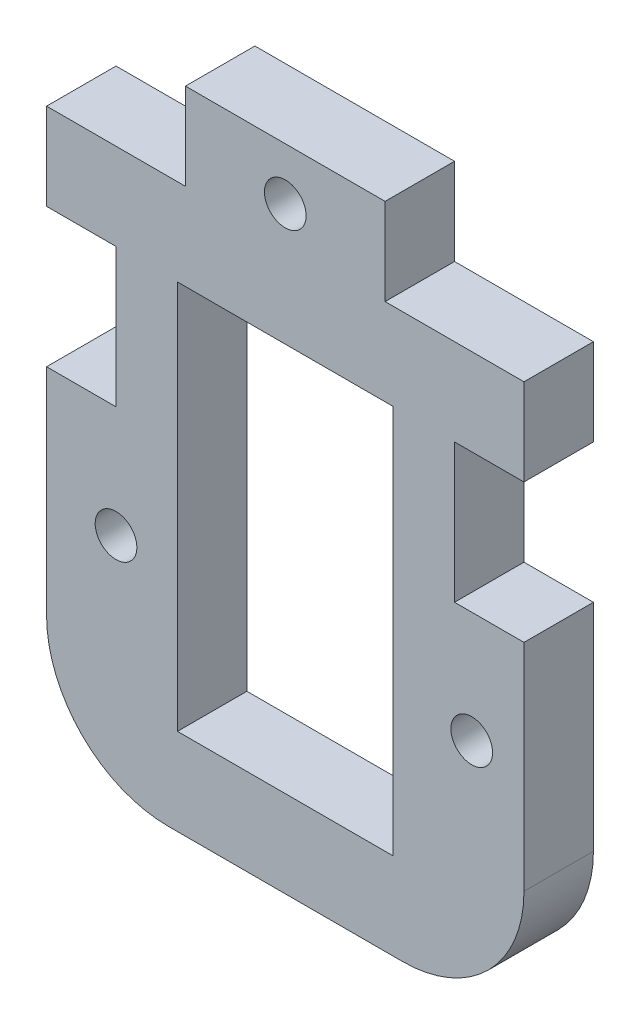
ISO-10303-21;
HEADER;
FILE_DESCRIPTION(('STEP AP214'),'2;1');
FILE_NAME('part.step','',(''),(''),'','','');
FILE_SCHEMA(('AUTOMOTIVE_DESIGN { 1 0 10303 214 1 1 1 1 }'));
ENDSEC;
DATA;
#1=APPLICATION_CONTEXT('core data for automotive mechanical design processes');
#2=APPLICATION_PROTOCOL_DEFINITION('international standard','automotive_design',2000,#1);
#3=PRODUCT_CONTEXT('',#1,'mechanical');
#4=PRODUCT('Part','Part','',(#3));
#5=PRODUCT_RELATED_PRODUCT_CATEGORY('part','',(#4));
#6=PRODUCT_DEFINITION_FORMATION('','',#4);
#7=PRODUCT_DEFINITION_CONTEXT('part definition',#1,'design');
#8=PRODUCT_DEFINITION('design','',#6,#7);
#9=PRODUCT_DEFINITION_SHAPE('','',#8);
#10=(LENGTH_UNIT() NAMED_UNIT(*) SI_UNIT(.MILLI.,.METRE.));
#11=(NAMED_UNIT(*) PLANE_ANGLE_UNIT() SI_UNIT($,.RADIAN.));
#12=(NAMED_UNIT(*) SI_UNIT($,.STERADIAN.) SOLID_ANGLE_UNIT());
#13=UNCERTAINTY_MEASURE_WITH_UNIT(LENGTH_MEASURE(1.E-05),#10,'distance_accuracy_value','');
#14=(GEOMETRIC_REPRESENTATION_CONTEXT(3) GLOBAL_UNCERTAINTY_ASSIGNED_CONTEXT((#13)) GLOBAL_UNIT_ASSIGNED_CONTEXT((#10,
#11,#12)) REPRESENTATION_CONTEXT('',''));
#15=CARTESIAN_POINT('',(0.,0.,0.));
#16=DIRECTION('',(0.,0.,1.));
#17=DIRECTION('',(1.,0.,0.));
#18=AXIS2_PLACEMENT_3D('',#15,#16,#17);
#19=CARTESIAN_POINT('',(7.54,0.,4.));
#20=DIRECTION('',(1.,0.,0.));
#21=DIRECTION('',(0.,0.,-1.));
#22=AXIS2_PLACEMENT_3D('',#19,#20,#21);
#23=PLANE('',#22);
#24=DIRECTION('',(0.,-1.,0.));
#25=VECTOR('',#24,1.);
#26=CARTESIAN_POINT('',(7.54,0.,0.));
#27=LINE('',#26,#25);
#28=CARTESIAN_POINT('',(7.54,27.42,0.));
#29=VERTEX_POINT('',#28);
#30=CARTESIAN_POINT('',(7.54,4.99999999999999,0.));
#31=VERTEX_POINT('',#30);
#32=EDGE_CURVE('E350',#29,#31,#27,.T.);
#33=ORIENTED_EDGE('',*,*,#32,.F.);
#34=DIRECTION('',(0.,0.,-1.));
#35=VECTOR('',#34,1.);
#36=CARTESIAN_POINT('',(7.54,27.42,4.));
#37=LINE('',#36,#35);
#38=CARTESIAN_POINT('',(7.54,27.42,4.));
#39=VERTEX_POINT('',#38);
#40=EDGE_CURVE('E376',#39,#29,#37,.T.);
#41=ORIENTED_EDGE('',*,*,#40,.F.);
#42=DIRECTION('',(0.,-1.,0.));
#43=VECTOR('',#42,1.);
#44=CARTESIAN_POINT('',(7.54,0.,4.));
#45=LINE('',#44,#43);
#46=CARTESIAN_POINT('',(7.54,4.99999999999999,4.));
#47=VERTEX_POINT('',#46);
#48=EDGE_CURVE('E269',#39,#47,#45,.T.);
#49=ORIENTED_EDGE('',*,*,#48,.T.);
#50=DIRECTION('',(0.,0.,-1.));
#51=VECTOR('',#50,1.);
#52=CARTESIAN_POINT('',(7.54,4.99999999999999,4.));
#53=LINE('',#52,#51);
#54=EDGE_CURVE('E201',#47,#31,#53,.T.);
#55=ORIENTED_EDGE('',*,*,#54,.T.);
#56=EDGE_LOOP('',(#33,#41,#49,#55));
#57=FACE_BOUND('',#56,.T.);
#58=ADVANCED_FACE('F39',(#57),#23,.T.);
#59=CARTESIAN_POINT('',(0.,27.42,4.));
#60=DIRECTION('',(0.,1.,0.));
#61=DIRECTION('',(0.,0.,1.));
#62=AXIS2_PLACEMENT_3D('',#59,#60,#61);
#63=PLANE('',#62);
#64=DIRECTION('',(1.,0.,0.));
#65=VECTOR('',#64,1.);
#66=CARTESIAN_POINT('',(0.,27.42,0.));
#67=LINE('',#66,#65);
#68=CARTESIAN_POINT('',(19.96,27.42,0.));
#69=VERTEX_POINT('',#68);
#70=EDGE_CURVE('E354',#29,#69,#67,.T.);
#71=ORIENTED_EDGE('',*,*,#70,.T.);
#72=DIRECTION('',(0.,0.,-1.));
#73=VECTOR('',#72,1.);
#74=CARTESIAN_POINT('',(19.96,27.42,4.));
#75=LINE('',#74,#73);
#76=CARTESIAN_POINT('',(19.96,27.42,4.));
#77=VERTEX_POINT('',#76);
#78=EDGE_CURVE('E372',#77,#69,#75,.T.);
#79=ORIENTED_EDGE('',*,*,#78,.F.);
#80=DIRECTION('',(1.,0.,0.));
#81=VECTOR('',#80,1.);
#82=CARTESIAN_POINT('',(0.,27.42,4.));
#83=LINE('',#82,#81);
#84=EDGE_CURVE('E273',#39,#77,#83,.T.);
#85=ORIENTED_EDGE('',*,*,#84,.F.);
#86=ORIENTED_EDGE('',*,*,#40,.T.);
#87=EDGE_LOOP('',(#71,#79,#85,#86));
#88=FACE_BOUND('',#87,.T.);
#89=ADVANCED_FACE('F517',(#88),#63,.F.);
#90=CARTESIAN_POINT('',(19.96,0.,4.));
#91=DIRECTION('',(1.,0.,0.));
#92=DIRECTION('',(0.,0.,-1.));
#93=AXIS2_PLACEMENT_3D('',#90,#91,#92);
#94=PLANE('',#93);
#95=DIRECTION('',(0.,-1.,0.));
#96=VECTOR('',#95,1.);
#97=CARTESIAN_POINT('',(19.96,0.,0.));
#98=LINE('',#97,#96);
#99=CARTESIAN_POINT('',(19.96,4.99999999999999,0.));
#100=VERTEX_POINT('',#99);
#101=EDGE_CURVE('E358',#69,#100,#98,.T.);
#102=ORIENTED_EDGE('',*,*,#101,.T.);
#103=DIRECTION('',(0.,0.,-1.));
#104=VECTOR('',#103,1.);
#105=CARTESIAN_POINT('',(19.96,4.99999999999999,4.));
#106=LINE('',#105,#104);
#107=CARTESIAN_POINT('',(19.96,4.99999999999999,4.));
#108=VERTEX_POINT('',#107);
#109=EDGE_CURVE('E369',#108,#100,#106,.T.);
#110=ORIENTED_EDGE('',*,*,#109,.F.);
#111=DIRECTION('',(0.,-1.,0.));
#112=VECTOR('',#111,1.);
#113=CARTESIAN_POINT('',(19.96,0.,4.));
#114=LINE('',#113,#112);
#115=EDGE_CURVE('E277',#77,#108,#114,.T.);
#116=ORIENTED_EDGE('',*,*,#115,.F.);
#117=ORIENTED_EDGE('',*,*,#78,.T.);
#118=EDGE_LOOP('',(#102,#110,#116,#117));
#119=FACE_BOUND('',#118,.T.);
#120=ADVANCED_FACE('F523',(#119),#94,.F.);
#121=CARTESIAN_POINT('',(23.5,0.,4.));
#122=DIRECTION('',(1.,0.,0.));
#123=DIRECTION('',(0.,1.,0.));
#124=AXIS2_PLACEMENT_3D('',#121,#122,#123);
#125=PLANE('',#124);
#126=DIRECTION('',(0.,-1.,0.));
#127=VECTOR('',#126,1.);
#128=CARTESIAN_POINT('',(23.5,0.,0.));
#129=LINE('',#128,#127);
#130=CARTESIAN_POINT('',(23.5,27.42,0.));
#131=VERTEX_POINT('',#130);
#132=CARTESIAN_POINT('',(23.5,19.42,0.));
#133=VERTEX_POINT('',#132);
#134=EDGE_CURVE('E195',#131,#133,#129,.T.);
#135=ORIENTED_EDGE('',*,*,#134,.F.);
#136=DIRECTION('',(0.,0.,-1.));
#137=VECTOR('',#136,1.);
#138=CARTESIAN_POINT('',(23.5,27.42,4.));
#139=LINE('',#138,#137);
#140=CARTESIAN_POINT('',(23.5,27.42,4.));
#141=VERTEX_POINT('',#140);
#142=EDGE_CURVE('E190',#141,#131,#139,.T.);
#143=ORIENTED_EDGE('',*,*,#142,.F.);
#144=DIRECTION('',(0.,-1.,0.));
#145=VECTOR('',#144,1.);
#146=CARTESIAN_POINT('',(23.5,0.,4.));
#147=LINE('',#146,#145);
#148=CARTESIAN_POINT('',(23.5,19.42,4.));
#149=VERTEX_POINT('',#148);
#150=EDGE_CURVE('E193',#141,#149,#147,.T.);
#151=ORIENTED_EDGE('',*,*,#150,.T.);
#152=DIRECTION('',(0.,0.,-1.));
#153=VECTOR('',#152,1.);
#154=CARTESIAN_POINT('',(23.5,19.42,4.));
#155=LINE('',#154,#153);
#156=EDGE_CURVE('E284',#149,#133,#155,.T.);
#157=ORIENTED_EDGE('',*,*,#156,.T.);
#158=EDGE_LOOP('',(#135,#143,#151,#157));
#159=FACE_BOUND('',#158,.T.);
#160=ADVANCED_FACE('F192',(#159),#125,.T.);
#161=CARTESIAN_POINT('',(0.,27.42,4.));
#162=DIRECTION('',(0.,-1.,0.));
#163=DIRECTION('',(0.,0.,-1.));
#164=AXIS2_PLACEMENT_3D('',#161,#162,#163);
#165=PLANE('',#164);
#166=DIRECTION('',(-1.,0.,0.));
#167=VECTOR('',#166,1.);
#168=CARTESIAN_POINT('',(0.,27.42,0.));
#169=LINE('',#168,#167);
#170=CARTESIAN_POINT('',(27.5,27.42,0.));
#171=VERTEX_POINT('',#170);
#172=EDGE_CURVE('E299',#171,#131,#169,.T.);
#173=ORIENTED_EDGE('',*,*,#172,.F.);
#174=DIRECTION('',(0.,0.,-1.));
#175=VECTOR('',#174,1.);
#176=CARTESIAN_POINT('',(27.5,27.42,4.));
#177=LINE('',#176,#175);
#178=CARTESIAN_POINT('',(27.5,27.42,4.));
#179=VERTEX_POINT('',#178);
#180=EDGE_CURVE('E202',#179,#171,#177,.T.);
#181=ORIENTED_EDGE('',*,*,#180,.F.);
#182=DIRECTION('',(-1.,0.,0.));
#183=VECTOR('',#182,1.);
#184=CARTESIAN_POINT('',(0.,27.42,4.));
#185=LINE('',#184,#183);
#186=EDGE_CURVE('E209',#179,#141,#185,.T.);
#187=ORIENTED_EDGE('',*,*,#186,.T.);
#188=ORIENTED_EDGE('',*,*,#142,.T.);
#189=EDGE_LOOP('',(#173,#181,#187,#188));
#190=FACE_BOUND('',#189,.T.);
#191=ADVANCED_FACE('F216',(#190),#165,.T.);
#192=CARTESIAN_POINT('',(27.5,0.,4.));
#193=DIRECTION('',(-1.,0.,0.));
#194=DIRECTION('',(0.,0.,1.));
#195=AXIS2_PLACEMENT_3D('',#192,#193,#194);
#196=PLANE('',#195);
#197=DIRECTION('',(0.,1.,0.));
#198=VECTOR('',#197,1.);
#199=CARTESIAN_POINT('',(27.5,0.,0.));
#200=LINE('',#199,#198);
#201=CARTESIAN_POINT('',(27.5,32.42,0.));
#202=VERTEX_POINT('',#201);
#203=EDGE_CURVE('E302',#171,#202,#200,.T.);
#204=ORIENTED_EDGE('',*,*,#203,.T.);
#205=DIRECTION('',(0.,0.,-1.));
#206=VECTOR('',#205,1.);
#207=CARTESIAN_POINT('',(27.5,32.42,4.));
#208=LINE('',#207,#206);
#209=CARTESIAN_POINT('',(27.5,32.42,4.));
#210=VERTEX_POINT('',#209);
#211=EDGE_CURVE('E415',#210,#202,#208,.T.);
#212=ORIENTED_EDGE('',*,*,#211,.F.);
#213=DIRECTION('',(0.,1.,0.));
#214=VECTOR('',#213,1.);
#215=CARTESIAN_POINT('',(27.5,0.,4.));
#216=LINE('',#215,#214);
#217=EDGE_CURVE('E219',#179,#210,#216,.T.);
#218=ORIENTED_EDGE('',*,*,#217,.F.);
#219=ORIENTED_EDGE('',*,*,#180,.T.);
#220=EDGE_LOOP('',(#204,#212,#218,#219));
#221=FACE_BOUND('',#220,.T.);
#222=ADVANCED_FACE('F503',(#221),#196,.F.);
#223=CARTESIAN_POINT('',(0.,32.42,4.));
#224=DIRECTION('',(0.,-1.,0.));
#225=DIRECTION('',(1.,0.,0.));
#226=AXIS2_PLACEMENT_3D('',#223,#224,#225);
#227=PLANE('',#226);
#228=DIRECTION('',(-1.,0.,0.));
#229=VECTOR('',#228,1.);
#230=CARTESIAN_POINT('',(0.,32.42,0.));
#231=LINE('',#230,#229);
#232=CARTESIAN_POINT('',(19.5,32.42,0.));
#233=VERTEX_POINT('',#232);
#234=EDGE_CURVE('E305',#202,#233,#231,.T.);
#235=ORIENTED_EDGE('',*,*,#234,.T.);
#236=DIRECTION('',(0.,0.,-1.));
#237=VECTOR('',#236,1.);
#238=CARTESIAN_POINT('',(19.5,32.42,4.));
#239=LINE('',#238,#237);
#240=CARTESIAN_POINT('',(19.5,32.42,4.));
#241=VERTEX_POINT('',#240);
#242=EDGE_CURVE('E412',#241,#233,#239,.T.);
#243=ORIENTED_EDGE('',*,*,#242,.F.);
#244=DIRECTION('',(-1.,0.,0.));
#245=VECTOR('',#244,1.);
#246=CARTESIAN_POINT('',(0.,32.42,4.));
#247=LINE('',#246,#245);
#248=EDGE_CURVE('E225',#210,#241,#247,.T.);
#249=ORIENTED_EDGE('',*,*,#248,.F.);
#250=ORIENTED_EDGE('',*,*,#211,.T.);
#251=EDGE_LOOP('',(#235,#243,#249,#250));
#252=FACE_BOUND('',#251,.T.);
#253=ADVANCED_FACE('F501',(#252),#227,.F.);
#254=CARTESIAN_POINT('',(19.5,0.,4.));
#255=DIRECTION('',(1.,0.,0.));
#256=DIRECTION('',(0.,0.,-1.));
#257=AXIS2_PLACEMENT_3D('',#254,#255,#256);
#258=PLANE('',#257);
#259=DIRECTION('',(0.,-1.,0.));
#260=VECTOR('',#259,1.);
#261=CARTESIAN_POINT('',(19.5,0.,0.));
#262=LINE('',#261,#260);
#263=CARTESIAN_POINT('',(19.5,37.42,0.));
#264=VERTEX_POINT('',#263);
#265=EDGE_CURVE('E310',#264,#233,#262,.T.);
#266=ORIENTED_EDGE('',*,*,#265,.F.);
#267=DIRECTION('',(0.,0.,-1.));
#268=VECTOR('',#267,1.);
#269=CARTESIAN_POINT('',(19.5,37.42,4.));
#270=LINE('',#269,#268);
#271=CARTESIAN_POINT('',(19.5,37.42,4.));
#272=VERTEX_POINT('',#271);
#273=EDGE_CURVE('E409',#272,#264,#270,.T.);
#274=ORIENTED_EDGE('',*,*,#273,.F.);
#275=DIRECTION('',(0.,-1.,0.));
#276=VECTOR('',#275,1.);
#277=CARTESIAN_POINT('',(19.5,0.,4.));
#278=LINE('',#277,#276);
#279=EDGE_CURVE('E232',#272,#241,#278,.T.);
#280=ORIENTED_EDGE('',*,*,#279,.T.);
#281=ORIENTED_EDGE('',*,*,#242,.T.);
#282=EDGE_LOOP('',(#266,#274,#280,#281));
#283=FACE_BOUND('',#282,.T.);
#284=ADVANCED_FACE('F496',(#283),#258,.T.);
#285=CARTESIAN_POINT('',(0.,37.42,4.));
#286=DIRECTION('',(0.,1.,0.));
#287=DIRECTION('',(0.,0.,1.));
#288=AXIS2_PLACEMENT_3D('',#285,#286,#287);
#289=PLANE('',#288);
#290=DIRECTION('',(1.,0.,0.));
#291=VECTOR('',#290,1.);
#292=CARTESIAN_POINT('',(0.,37.42,0.));
#293=LINE('',#292,#291);
#294=CARTESIAN_POINT('',(8.,37.42,0.));
#295=VERTEX_POINT('',#294);
#296=EDGE_CURVE('E314',#295,#264,#293,.T.);
#297=ORIENTED_EDGE('',*,*,#296,.F.);
#298=DIRECTION('',(0.,0.,-1.));
#299=VECTOR('',#298,1.);
#300=CARTESIAN_POINT('',(8.,37.42,4.));
#301=LINE('',#300,#299);
#302=CARTESIAN_POINT('',(8.,37.42,4.));
#303=VERTEX_POINT('',#302);
#304=EDGE_CURVE('E406',#303,#295,#301,.T.);
#305=ORIENTED_EDGE('',*,*,#304,.F.);
#306=DIRECTION('',(1.,0.,0.));
#307=VECTOR('',#306,1.);
#308=CARTESIAN_POINT('',(0.,37.42,4.));
#309=LINE('',#308,#307);
#310=EDGE_CURVE('E236',#303,#272,#309,.T.);
#311=ORIENTED_EDGE('',*,*,#310,.T.);
#312=ORIENTED_EDGE('',*,*,#273,.T.);
#313=EDGE_LOOP('',(#297,#305,#311,#312));
#314=FACE_BOUND('',#313,.T.);
#315=ADVANCED_FACE('F492',(#314),#289,.T.);
#316=CARTESIAN_POINT('',(8.,0.,4.));
#317=DIRECTION('',(-1.,0.,0.));
#318=DIRECTION('',(0.,0.,1.));
#319=AXIS2_PLACEMENT_3D('',#316,#317,#318);
#320=PLANE('',#319);
#321=DIRECTION('',(0.,1.,0.));
#322=VECTOR('',#321,1.);
#323=CARTESIAN_POINT('',(8.,0.,0.));
#324=LINE('',#323,#322);
#325=CARTESIAN_POINT('',(8.,32.42,0.));
#326=VERTEX_POINT('',#325);
#327=EDGE_CURVE('E318',#326,#295,#324,.T.);
#328=ORIENTED_EDGE('',*,*,#327,.F.);
#329=DIRECTION('',(0.,0.,-1.));
#330=VECTOR('',#329,1.);
#331=CARTESIAN_POINT('',(8.,32.42,4.));
#332=LINE('',#331,#330);
#333=CARTESIAN_POINT('',(8.,32.42,4.));
#334=VERTEX_POINT('',#333);
#335=EDGE_CURVE('E403',#334,#326,#332,.T.);
#336=ORIENTED_EDGE('',*,*,#335,.F.);
#337=DIRECTION('',(0.,1.,0.));
#338=VECTOR('',#337,1.);
#339=CARTESIAN_POINT('',(8.,0.,4.));
#340=LINE('',#339,#338);
#341=EDGE_CURVE('E240',#334,#303,#340,.T.);
#342=ORIENTED_EDGE('',*,*,#341,.T.);
#343=ORIENTED_EDGE('',*,*,#304,.T.);
#344=EDGE_LOOP('',(#328,#336,#342,#343));
#345=FACE_BOUND('',#344,.T.);
#346=ADVANCED_FACE('F488',(#345),#320,.T.);
#347=CARTESIAN_POINT('',(0.,32.42,4.));
#348=DIRECTION('',(0.,1.,0.));
#349=DIRECTION('',(0.,0.,1.));
#350=AXIS2_PLACEMENT_3D('',#347,#348,#349);
#351=PLANE('',#350);
#352=DIRECTION('',(1.,0.,0.));
#353=VECTOR('',#352,1.);
#354=CARTESIAN_POINT('',(0.,32.42,0.));
#355=LINE('',#354,#353);
#356=CARTESIAN_POINT('',(0.,32.42,0.));
#357=VERTEX_POINT('',#356);
#358=EDGE_CURVE('E322',#357,#326,#355,.T.);
#359=ORIENTED_EDGE('',*,*,#358,.F.);
#360=DIRECTION('',(0.,0.,-1.));
#361=VECTOR('',#360,1.);
#362=CARTESIAN_POINT('',(0.,32.42,4.));
#363=LINE('',#362,#361);
#364=CARTESIAN_POINT('',(0.,32.42,4.));
#365=VERTEX_POINT('',#364);
#366=EDGE_CURVE('E400',#365,#357,#363,.T.);
#367=ORIENTED_EDGE('',*,*,#366,.F.);
#368=DIRECTION('',(1.,0.,0.));
#369=VECTOR('',#368,1.);
#370=CARTESIAN_POINT('',(0.,32.42,4.));
#371=LINE('',#370,#369);
#372=EDGE_CURVE('E244',#365,#334,#371,.T.);
#373=ORIENTED_EDGE('',*,*,#372,.T.);
#374=ORIENTED_EDGE('',*,*,#335,.T.);
#375=EDGE_LOOP('',(#359,#367,#373,#374));
#376=FACE_BOUND('',#375,.T.);
#377=ADVANCED_FACE('F484',(#376),#351,.T.);
#378=CARTESIAN_POINT('',(0.,0.,4.));
#379=DIRECTION('',(-1.,0.,0.));
#380=DIRECTION('',(0.,0.,1.));
#381=AXIS2_PLACEMENT_3D('',#378,#379,#380);
#382=PLANE('',#381);
#383=DIRECTION('',(0.,1.,0.));
#384=VECTOR('',#383,1.);
#385=CARTESIAN_POINT('',(0.,0.,0.));
#386=LINE('',#385,#384);
#387=CARTESIAN_POINT('',(0.,27.42,0.));
#388=VERTEX_POINT('',#387);
#389=EDGE_CURVE('E326',#388,#357,#386,.T.);
#390=ORIENTED_EDGE('',*,*,#389,.F.);
#391=DIRECTION('',(0.,0.,-1.));
#392=VECTOR('',#391,1.);
#393=CARTESIAN_POINT('',(0.,27.42,4.));
#394=LINE('',#393,#392);
#395=CARTESIAN_POINT('',(0.,27.42,4.));
#396=VERTEX_POINT('',#395);
#397=EDGE_CURVE('E397',#396,#388,#394,.T.);
#398=ORIENTED_EDGE('',*,*,#397,.F.);
#399=DIRECTION('',(0.,1.,0.));
#400=VECTOR('',#399,1.);
#401=CARTESIAN_POINT('',(0.,0.,4.));
#402=LINE('',#401,#400);
#403=EDGE_CURVE('E248',#396,#365,#402,.T.);
#404=ORIENTED_EDGE('',*,*,#403,.T.);
#405=ORIENTED_EDGE('',*,*,#366,.T.);
#406=EDGE_LOOP('',(#390,#398,#404,#405));
#407=FACE_BOUND('',#406,.T.);
#408=ADVANCED_FACE('F480',(#407),#382,.T.);
#409=CARTESIAN_POINT('',(0.,27.42,4.));
#410=DIRECTION('',(0.,1.,0.));
#411=DIRECTION('',(0.,0.,1.));
#412=AXIS2_PLACEMENT_3D('',#409,#410,#411);
#413=PLANE('',#412);
#414=DIRECTION('',(1.,0.,0.));
#415=VECTOR('',#414,1.);
#416=CARTESIAN_POINT('',(0.,27.42,0.));
#417=LINE('',#416,#415);
#418=CARTESIAN_POINT('',(4.,27.42,0.));
#419=VERTEX_POINT('',#418);
#420=EDGE_CURVE('E330',#388,#419,#417,.T.);
#421=ORIENTED_EDGE('',*,*,#420,.T.);
#422=DIRECTION('',(0.,0.,-1.));
#423=VECTOR('',#422,1.);
#424=CARTESIAN_POINT('',(4.,27.42,4.));
#425=LINE('',#424,#423);
#426=CARTESIAN_POINT('',(4.,27.42,4.));
#427=VERTEX_POINT('',#426);
#428=EDGE_CURVE('E393',#427,#419,#425,.T.);
#429=ORIENTED_EDGE('',*,*,#428,.F.);
#430=DIRECTION('',(1.,0.,0.));
#431=VECTOR('',#430,1.);
#432=CARTESIAN_POINT('',(0.,27.42,4.));
#433=LINE('',#432,#431);
#434=EDGE_CURVE('E252',#396,#427,#433,.T.);
#435=ORIENTED_EDGE('',*,*,#434,.F.);
#436=ORIENTED_EDGE('',*,*,#397,.T.);
#437=EDGE_LOOP('',(#421,#429,#435,#436));
#438=FACE_BOUND('',#437,.T.);
#439=ADVANCED_FACE('F642',(#438),#413,.F.);
#440=CARTESIAN_POINT('',(4.,0.,4.));
#441=DIRECTION('',(1.,0.,0.));
#442=DIRECTION('',(0.,1.,0.));
#443=AXIS2_PLACEMENT_3D('',#440,#441,#442);
#444=PLANE('',#443);
#445=DIRECTION('',(0.,-1.,0.));
#446=VECTOR('',#445,1.);
#447=CARTESIAN_POINT('',(4.,0.,0.));
#448=LINE('',#447,#446);
#449=CARTESIAN_POINT('',(4.,19.42,0.));
#450=VERTEX_POINT('',#449);
#451=EDGE_CURVE('E335',#419,#450,#448,.T.);
#452=ORIENTED_EDGE('',*,*,#451,.T.);
#453=DIRECTION('',(0.,0.,-1.));
#454=VECTOR('',#453,1.);
#455=CARTESIAN_POINT('',(4.,19.42,4.));
#456=LINE('',#455,#454);
#457=CARTESIAN_POINT('',(4.,19.42,4.));
#458=VERTEX_POINT('',#457);
#459=EDGE_CURVE('E390',#458,#450,#456,.T.);
#460=ORIENTED_EDGE('',*,*,#459,.F.);
#461=DIRECTION('',(0.,-1.,0.));
#462=VECTOR('',#461,1.);
#463=CARTESIAN_POINT('',(4.,0.,4.));
#464=LINE('',#463,#462);
#465=EDGE_CURVE('E257',#427,#458,#464,.T.);
#466=ORIENTED_EDGE('',*,*,#465,.F.);
#467=ORIENTED_EDGE('',*,*,#428,.T.);
#468=EDGE_LOOP('',(#452,#460,#466,#467));
#469=FACE_BOUND('',#468,.T.);
#470=ADVANCED_FACE('F475',(#469),#444,.F.);
#471=CARTESIAN_POINT('',(0.,19.42,4.));
#472=DIRECTION('',(0.,1.,0.));
#473=DIRECTION('',(0.,0.,1.));
#474=AXIS2_PLACEMENT_3D('',#471,#472,#473);
#475=PLANE('',#474);
#476=DIRECTION('',(1.,0.,0.));
#477=VECTOR('',#476,1.);
#478=CARTESIAN_POINT('',(0.,19.42,0.));
#479=LINE('',#478,#477);
#480=CARTESIAN_POINT('',(0.,19.42,0.));
#481=VERTEX_POINT('',#480);
#482=EDGE_CURVE('E339',#481,#450,#479,.T.);
#483=ORIENTED_EDGE('',*,*,#482,.F.);
#484=DIRECTION('',(0.,0.,-1.));
#485=VECTOR('',#484,1.);
#486=CARTESIAN_POINT('',(0.,19.42,4.));
#487=LINE('',#486,#485);
#488=CARTESIAN_POINT('',(0.,19.42,4.));
#489=VERTEX_POINT('',#488);
#490=EDGE_CURVE('E386',#489,#481,#487,.T.);
#491=ORIENTED_EDGE('',*,*,#490,.F.);
#492=DIRECTION('',(1.,0.,0.));
#493=VECTOR('',#492,1.);
#494=CARTESIAN_POINT('',(0.,19.42,4.));
#495=LINE('',#494,#493);
#496=EDGE_CURVE('E260',#489,#458,#495,.T.);
#497=ORIENTED_EDGE('',*,*,#496,.T.);
#498=ORIENTED_EDGE('',*,*,#459,.T.);
#499=EDGE_LOOP('',(#483,#491,#497,#498));
#500=FACE_BOUND('',#499,.T.);
#501=ADVANCED_FACE('F469',(#500),#475,.T.);
#502=CARTESIAN_POINT('',(0.,7.,0.));
#503=VERTEX_POINT('',#502);
#504=EDGE_CURVE('E331',#503,#481,#386,.T.);
#505=ORIENTED_EDGE('',*,*,#504,.F.);
#506=DIRECTION('',(0.,0.,-1.));
#507=VECTOR('',#506,1.);
#508=CARTESIAN_POINT('',(0.,7.,4.));
#509=LINE('',#508,#507);
#510=CARTESIAN_POINT('',(0.,7.,4.));
#511=VERTEX_POINT('',#510);
#512=EDGE_CURVE('E11',#503,#511,#509,.F.);
#513=ORIENTED_EDGE('',*,*,#512,.T.);
#514=EDGE_CURVE('E253',#511,#489,#402,.T.);
#515=ORIENTED_EDGE('',*,*,#514,.T.);
#516=ORIENTED_EDGE('',*,*,#490,.T.);
#517=EDGE_LOOP('',(#505,#513,#515,#516));
#518=FACE_BOUND('',#517,.T.);
#519=ADVANCED_FACE('F459',(#518),#382,.T.);
#520=CARTESIAN_POINT('',(0.,0.,4.));
#521=DIRECTION('',(0.,1.,0.));
#522=DIRECTION('',(0.,0.,1.));
#523=AXIS2_PLACEMENT_3D('',#520,#521,#522);
#524=PLANE('',#523);
#525=DIRECTION('',(1.,0.,0.));
#526=VECTOR('',#525,1.);
#527=CARTESIAN_POINT('',(0.,0.,0.));
#528=LINE('',#527,#526);
#529=CARTESIAN_POINT('',(7.,0.,0.));
#530=VERTEX_POINT('',#529);
#531=CARTESIAN_POINT('',(20.5,0.,0.));
#532=VERTEX_POINT('',#531);
#533=EDGE_CURVE('E343',#530,#532,#528,.T.);
#534=ORIENTED_EDGE('',*,*,#533,.T.);
#535=DIRECTION('',(0.,0.,-1.));
#536=VECTOR('',#535,1.);
#537=CARTESIAN_POINT('',(20.5,0.,4.));
#538=LINE('',#537,#536);
#539=CARTESIAN_POINT('',(20.5,0.,4.));
#540=VERTEX_POINT('',#539);
#541=EDGE_CURVE('E61',#532,#540,#538,.F.);
#542=ORIENTED_EDGE('',*,*,#541,.T.);
#543=DIRECTION('',(1.,0.,0.));
#544=VECTOR('',#543,1.);
#545=CARTESIAN_POINT('',(0.,0.,4.));
#546=LINE('',#545,#544);
#547=CARTESIAN_POINT('',(7.,0.,4.));
#548=VERTEX_POINT('',#547);
#549=EDGE_CURVE('E264',#548,#540,#546,.T.);
#550=ORIENTED_EDGE('',*,*,#549,.F.);
#551=DIRECTION('',(0.,0.,-1.));
#552=VECTOR('',#551,1.);
#553=CARTESIAN_POINT('',(7.,0.,0.));
#554=LINE('',#553,#552);
#555=EDGE_CURVE('E429',#548,#530,#554,.T.);
#556=ORIENTED_EDGE('',*,*,#555,.T.);
#557=EDGE_LOOP('',(#534,#542,#550,#556));
#558=FACE_BOUND('',#557,.T.);
#559=ADVANCED_FACE('F455',(#558),#524,.F.);
#560=CARTESIAN_POINT('',(27.5,7.,4.));
#561=VERTEX_POINT('',#560);
#562=CARTESIAN_POINT('',(27.5,19.42,4.));
#563=VERTEX_POINT('',#562);
#564=EDGE_CURVE('E227',#561,#563,#216,.T.);
#565=ORIENTED_EDGE('',*,*,#564,.F.);
#566=DIRECTION('',(0.,0.,-1.));
#567=VECTOR('',#566,1.);
#568=CARTESIAN_POINT('',(27.5,7.,4.));
#569=LINE('',#568,#567);
#570=CARTESIAN_POINT('',(27.5,7.,0.));
#571=VERTEX_POINT('',#570);
#572=EDGE_CURVE('E379',#561,#571,#569,.T.);
#573=ORIENTED_EDGE('',*,*,#572,.T.);
#574=CARTESIAN_POINT('',(27.5,19.42,0.));
#575=VERTEX_POINT('',#574);
#576=EDGE_CURVE('E306',#571,#575,#200,.T.);
#577=ORIENTED_EDGE('',*,*,#576,.T.);
#578=DIRECTION('',(0.,0.,-1.));
#579=VECTOR('',#578,1.);
#580=CARTESIAN_POINT('',(27.5,19.42,4.));
#581=LINE('',#580,#579);
#582=EDGE_CURVE('E382',#563,#575,#581,.T.);
#583=ORIENTED_EDGE('',*,*,#582,.F.);
#584=EDGE_LOOP('',(#565,#573,#577,#583));
#585=FACE_BOUND('',#584,.T.);
#586=ADVANCED_FACE('F446',(#585),#196,.F.);
#587=CARTESIAN_POINT('',(0.,19.42,4.));
#588=DIRECTION('',(0.,-1.,0.));
#589=DIRECTION('',(0.,0.,-1.));
#590=AXIS2_PLACEMENT_3D('',#587,#588,#589);
#591=PLANE('',#590);
#592=DIRECTION('',(-1.,0.,0.));
#593=VECTOR('',#592,1.);
#594=CARTESIAN_POINT('',(0.,19.42,0.));
#595=LINE('',#594,#593);
#596=EDGE_CURVE('E346',#575,#133,#595,.T.);
#597=ORIENTED_EDGE('',*,*,#596,.T.);
#598=ORIENTED_EDGE('',*,*,#156,.F.);
#599=DIRECTION('',(-1.,0.,0.));
#600=VECTOR('',#599,1.);
#601=CARTESIAN_POINT('',(0.,19.42,4.));
#602=LINE('',#601,#600);
#603=EDGE_CURVE('E211',#563,#149,#602,.T.);
#604=ORIENTED_EDGE('',*,*,#603,.F.);
#605=ORIENTED_EDGE('',*,*,#582,.T.);
#606=EDGE_LOOP('',(#597,#598,#604,#605));
#607=FACE_BOUND('',#606,.T.);
#608=ADVANCED_FACE('F515',(#607),#591,.F.);
#609=CARTESIAN_POINT('',(24.49,13.0099999999999,4.));
#610=DIRECTION('',(0.,0.,-1.));
#611=DIRECTION('',(-1.,0.,0.));
#612=AXIS2_PLACEMENT_3D('',#609,#610,#611);
#613=CYLINDRICAL_SURFACE('',#612,1.2);
#614=CARTESIAN_POINT('',(24.49,13.0099999999999,4.));
#615=DIRECTION('',(0.,0.,1.));
#616=DIRECTION('',(1.,0.,0.));
#617=AXIS2_PLACEMENT_3D('',#614,#615,#616);
#618=CIRCLE('',#617,1.2);
#619=CARTESIAN_POINT('',(25.69,13.0099999999999,4.));
#620=VERTEX_POINT('',#619);
#621=EDGE_CURVE('E214',#620,#620,#618,.T.);
#622=ORIENTED_EDGE('',*,*,#621,.T.);
#623=EDGE_LOOP('',(#622));
#624=FACE_BOUND('',#623,.T.);
#625=CARTESIAN_POINT('',(24.49,13.0099999999999,0.));
#626=DIRECTION('',(0.,0.,1.));
#627=DIRECTION('',(1.,0.,0.));
#628=AXIS2_PLACEMENT_3D('',#625,#626,#627);
#629=CIRCLE('',#628,1.2);
#630=CARTESIAN_POINT('',(25.69,13.0099999999999,0.));
#631=VERTEX_POINT('',#630);
#632=EDGE_CURVE('E293',#631,#631,#629,.T.);
#633=ORIENTED_EDGE('',*,*,#632,.F.);
#634=EDGE_LOOP('',(#633));
#635=FACE_BOUND('',#634,.T.);
#636=ADVANCED_FACE('F529',(#624,#635),#613,.F.);
#637=CARTESIAN_POINT('',(4.,13.,4.));
#638=DIRECTION('',(0.,0.,-1.));
#639=DIRECTION('',(-1.,0.,0.));
#640=AXIS2_PLACEMENT_3D('',#637,#638,#639);
#641=CYLINDRICAL_SURFACE('',#640,1.2);
#642=CARTESIAN_POINT('',(4.,13.,4.));
#643=DIRECTION('',(0.,0.,1.));
#644=DIRECTION('',(1.,0.,0.));
#645=AXIS2_PLACEMENT_3D('',#642,#643,#644);
#646=CIRCLE('',#645,1.2);
#647=CARTESIAN_POINT('',(5.2,13.,4.));
#648=VERTEX_POINT('',#647);
#649=EDGE_CURVE('E820',#648,#648,#646,.T.);
#650=ORIENTED_EDGE('',*,*,#649,.T.);
#651=EDGE_LOOP('',(#650));
#652=FACE_BOUND('',#651,.T.);
#653=CARTESIAN_POINT('',(4.,13.,0.));
#654=DIRECTION('',(0.,0.,1.));
#655=DIRECTION('',(1.,0.,0.));
#656=AXIS2_PLACEMENT_3D('',#653,#654,#655);
#657=CIRCLE('',#656,1.2);
#658=CARTESIAN_POINT('',(5.2,13.,0.));
#659=VERTEX_POINT('',#658);
#660=EDGE_CURVE('E289',#659,#659,#657,.T.);
#661=ORIENTED_EDGE('',*,*,#660,.F.);
#662=EDGE_LOOP('',(#661));
#663=FACE_BOUND('',#662,.T.);
#664=ADVANCED_FACE('F534',(#652,#663),#641,.F.);
#665=CARTESIAN_POINT('',(13.75,34.42,4.));
#666=DIRECTION('',(0.,0.,-1.));
#667=DIRECTION('',(-1.,0.,0.));
#668=AXIS2_PLACEMENT_3D('',#665,#666,#667);
#669=CYLINDRICAL_SURFACE('',#668,1.2);
#670=CARTESIAN_POINT('',(13.75,34.42,4.));
#671=DIRECTION('',(0.,0.,1.));
#672=DIRECTION('',(1.,0.,0.));
#673=AXIS2_PLACEMENT_3D('',#670,#671,#672);
#674=CIRCLE('',#673,1.2);
#675=CARTESIAN_POINT('',(14.95,34.42,4.));
#676=VERTEX_POINT('',#675);
#677=EDGE_CURVE('E366',#676,#676,#674,.T.);
#678=ORIENTED_EDGE('',*,*,#677,.T.);
#679=EDGE_LOOP('',(#678));
#680=FACE_BOUND('',#679,.T.);
#681=CARTESIAN_POINT('',(13.75,34.42,0.));
#682=DIRECTION('',(0.,0.,1.));
#683=DIRECTION('',(1.,0.,0.));
#684=AXIS2_PLACEMENT_3D('',#681,#682,#683);
#685=CIRCLE('',#684,1.2);
#686=CARTESIAN_POINT('',(14.95,34.42,0.));
#687=VERTEX_POINT('',#686);
#688=EDGE_CURVE('E285',#687,#687,#685,.T.);
#689=ORIENTED_EDGE('',*,*,#688,.F.);
#690=EDGE_LOOP('',(#689));
#691=FACE_BOUND('',#690,.T.);
#692=ADVANCED_FACE('F540',(#680,#691),#669,.F.);
#693=CARTESIAN_POINT('',(0.,4.99999999999998,4.));
#694=DIRECTION('',(0.,1.,0.));
#695=DIRECTION('',(-1.,0.,0.));
#696=AXIS2_PLACEMENT_3D('',#693,#694,#695);
#697=PLANE('',#696);
#698=DIRECTION('',(1.,0.,0.));
#699=VECTOR('',#698,1.);
#700=CARTESIAN_POINT('',(0.,4.99999999999998,0.));
#701=LINE('',#700,#699);
#702=EDGE_CURVE('E362',#31,#100,#701,.T.);
#703=ORIENTED_EDGE('',*,*,#702,.F.);
#704=ORIENTED_EDGE('',*,*,#54,.F.);
#705=DIRECTION('',(1.,0.,0.));
#706=VECTOR('',#705,1.);
#707=CARTESIAN_POINT('',(0.,4.99999999999998,4.));
#708=LINE('',#707,#706);
#709=EDGE_CURVE('E280',#47,#108,#708,.T.);
#710=ORIENTED_EDGE('',*,*,#709,.T.);
#711=ORIENTED_EDGE('',*,*,#109,.T.);
#712=EDGE_LOOP('',(#703,#704,#710,#711));
#713=FACE_BOUND('',#712,.T.);
#714=ADVANCED_FACE('F548',(#713),#697,.T.);
#715=CARTESIAN_POINT('',(0.,0.,4.));
#716=DIRECTION('',(0.,0.,1.));
#717=DIRECTION('',(1.,0.,0.));
#718=AXIS2_PLACEMENT_3D('',#715,#716,#717);
#719=PLANE('',#718);
#720=ORIENTED_EDGE('',*,*,#677,.F.);
#721=EDGE_LOOP('',(#720));
#722=FACE_BOUND('',#721,.T.);
#723=ORIENTED_EDGE('',*,*,#649,.F.);
#724=EDGE_LOOP('',(#723));
#725=FACE_BOUND('',#724,.T.);
#726=ORIENTED_EDGE('',*,*,#621,.F.);
#727=EDGE_LOOP('',(#726));
#728=FACE_BOUND('',#727,.T.);
#729=ORIENTED_EDGE('',*,*,#549,.T.);
#730=CARTESIAN_POINT('',(20.5,7.,4.));
#731=DIRECTION('',(0.,0.,1.));
#732=DIRECTION('',(1.,0.,0.));
#733=AXIS2_PLACEMENT_3D('',#730,#731,#732);
#734=CIRCLE('',#733,7.);
#735=EDGE_CURVE('E48',#540,#561,#734,.T.);
#736=ORIENTED_EDGE('',*,*,#735,.T.);
#737=ORIENTED_EDGE('',*,*,#564,.T.);
#738=ORIENTED_EDGE('',*,*,#603,.T.);
#739=ORIENTED_EDGE('',*,*,#150,.F.);
#740=ORIENTED_EDGE('',*,*,#186,.F.);
#741=ORIENTED_EDGE('',*,*,#217,.T.);
#742=ORIENTED_EDGE('',*,*,#248,.T.);
#743=ORIENTED_EDGE('',*,*,#279,.F.);
#744=ORIENTED_EDGE('',*,*,#310,.F.);
#745=ORIENTED_EDGE('',*,*,#341,.F.);
#746=ORIENTED_EDGE('',*,*,#372,.F.);
#747=ORIENTED_EDGE('',*,*,#403,.F.);
#748=ORIENTED_EDGE('',*,*,#434,.T.);
#749=ORIENTED_EDGE('',*,*,#465,.T.);
#750=ORIENTED_EDGE('',*,*,#496,.F.);
#751=ORIENTED_EDGE('',*,*,#514,.F.);
#752=CARTESIAN_POINT('',(7.,7.,4.));
#753=DIRECTION('',(0.,0.,1.));
#754=DIRECTION('',(1.,0.,0.));
#755=AXIS2_PLACEMENT_3D('',#752,#753,#754);
#756=CIRCLE('',#755,7.);
#757=EDGE_CURVE('E435',#511,#548,#756,.T.);
#758=ORIENTED_EDGE('',*,*,#757,.T.);
#759=EDGE_LOOP('',(#729,#736,#737,#738,#739,#740,#741,#742,#743,#744,#745,#746,#747,#748,#749,
#750,#751,#758));
#760=FACE_BOUND('',#759,.T.);
#761=ORIENTED_EDGE('',*,*,#48,.F.);
#762=ORIENTED_EDGE('',*,*,#84,.T.);
#763=ORIENTED_EDGE('',*,*,#115,.T.);
#764=ORIENTED_EDGE('',*,*,#709,.F.);
#765=EDGE_LOOP('',(#761,#762,#763,#764));
#766=FACE_BOUND('',#765,.T.);
#767=ADVANCED_FACE('F206',(#722,#725,#728,#760,#766),#719,.T.);
#768=CARTESIAN_POINT('',(0.,0.,0.));
#769=DIRECTION('',(0.,0.,1.));
#770=DIRECTION('',(1.,0.,0.));
#771=AXIS2_PLACEMENT_3D('',#768,#769,#770);
#772=PLANE('',#771);
#773=ORIENTED_EDGE('',*,*,#688,.T.);
#774=EDGE_LOOP('',(#773));
#775=FACE_BOUND('',#774,.T.);
#776=ORIENTED_EDGE('',*,*,#660,.T.);
#777=EDGE_LOOP('',(#776));
#778=FACE_BOUND('',#777,.T.);
#779=ORIENTED_EDGE('',*,*,#632,.T.);
#780=EDGE_LOOP('',(#779));
#781=FACE_BOUND('',#780,.T.);
#782=ORIENTED_EDGE('',*,*,#576,.F.);
#783=CARTESIAN_POINT('',(20.5,7.,0.));
#784=DIRECTION('',(0.,0.,1.));
#785=DIRECTION('',(1.,0.,0.));
#786=AXIS2_PLACEMENT_3D('',#783,#784,#785);
#787=CIRCLE('',#786,7.);
#788=EDGE_CURVE('E426',#571,#532,#787,.F.);
#789=ORIENTED_EDGE('',*,*,#788,.T.);
#790=ORIENTED_EDGE('',*,*,#533,.F.);
#791=CARTESIAN_POINT('',(7.,7.,0.));
#792=DIRECTION('',(0.,0.,1.));
#793=DIRECTION('',(1.,0.,0.));
#794=AXIS2_PLACEMENT_3D('',#791,#792,#793);
#795=CIRCLE('',#794,7.);
#796=EDGE_CURVE('E423',#530,#503,#795,.F.);
#797=ORIENTED_EDGE('',*,*,#796,.T.);
#798=ORIENTED_EDGE('',*,*,#504,.T.);
#799=ORIENTED_EDGE('',*,*,#482,.T.);
#800=ORIENTED_EDGE('',*,*,#451,.F.);
#801=ORIENTED_EDGE('',*,*,#420,.F.);
#802=ORIENTED_EDGE('',*,*,#389,.T.);
#803=ORIENTED_EDGE('',*,*,#358,.T.);
#804=ORIENTED_EDGE('',*,*,#327,.T.);
#805=ORIENTED_EDGE('',*,*,#296,.T.);
#806=ORIENTED_EDGE('',*,*,#265,.T.);
#807=ORIENTED_EDGE('',*,*,#234,.F.);
#808=ORIENTED_EDGE('',*,*,#203,.F.);
#809=ORIENTED_EDGE('',*,*,#172,.T.);
#810=ORIENTED_EDGE('',*,*,#134,.T.);
#811=ORIENTED_EDGE('',*,*,#596,.F.);
#812=EDGE_LOOP('',(#782,#789,#790,#797,#798,#799,#800,#801,#802,#803,#804,#805,#806,#807,#808,
#809,#810,#811));
#813=FACE_BOUND('',#812,.T.);
#814=ORIENTED_EDGE('',*,*,#32,.T.);
#815=ORIENTED_EDGE('',*,*,#702,.T.);
#816=ORIENTED_EDGE('',*,*,#101,.F.);
#817=ORIENTED_EDGE('',*,*,#70,.F.);
#818=EDGE_LOOP('',(#814,#815,#816,#817));
#819=FACE_BOUND('',#818,.T.);
#820=ADVANCED_FACE('F452',(#775,#778,#781,#813,#819),#772,.F.);
#821=CARTESIAN_POINT('',(20.5,7.,4.));
#822=DIRECTION('',(0.,0.,-1.));
#823=DIRECTION('',(-1.,0.,0.));
#824=AXIS2_PLACEMENT_3D('',#821,#822,#823);
#825=CYLINDRICAL_SURFACE('',#824,7.);
#826=ORIENTED_EDGE('',*,*,#735,.F.);
#827=ORIENTED_EDGE('',*,*,#541,.F.);
#828=ORIENTED_EDGE('',*,*,#788,.F.);
#829=ORIENTED_EDGE('',*,*,#572,.F.);
#830=EDGE_LOOP('',(#826,#827,#828,#829));
#831=FACE_BOUND('',#830,.T.);
#832=ADVANCED_FACE('F449',(#831),#825,.T.);
#833=CARTESIAN_POINT('',(7.,7.,4.));
#834=DIRECTION('',(0.,0.,1.));
#835=DIRECTION('',(1.,0.,0.));
#836=AXIS2_PLACEMENT_3D('',#833,#834,#835);
#837=CYLINDRICAL_SURFACE('',#836,7.);
#838=ORIENTED_EDGE('',*,*,#757,.F.);
#839=ORIENTED_EDGE('',*,*,#512,.F.);
#840=ORIENTED_EDGE('',*,*,#796,.F.);
#841=ORIENTED_EDGE('',*,*,#555,.F.);
#842=EDGE_LOOP('',(#838,#839,#840,#841));
#843=FACE_BOUND('',#842,.T.);
#844=ADVANCED_FACE('F41',(#843),#837,.T.);
#845=CLOSED_SHELL('',(#58,#89,#120,#160,#191,#222,#253,#284,#315,#346,#377,#408,#439,#470,#501,
#519,#559,#586,#608,#636,#664,#692,#714,#767,#820,#832,#844));
#846=MANIFOLD_SOLID_BREP('B2',#845);
#847=ADVANCED_BREP_SHAPE_REPRESENTATION('',(#18,#846),#14);
#848=SHAPE_DEFINITION_REPRESENTATION(#9,#847);
ENDSEC;
END-ISO-10303-21;
